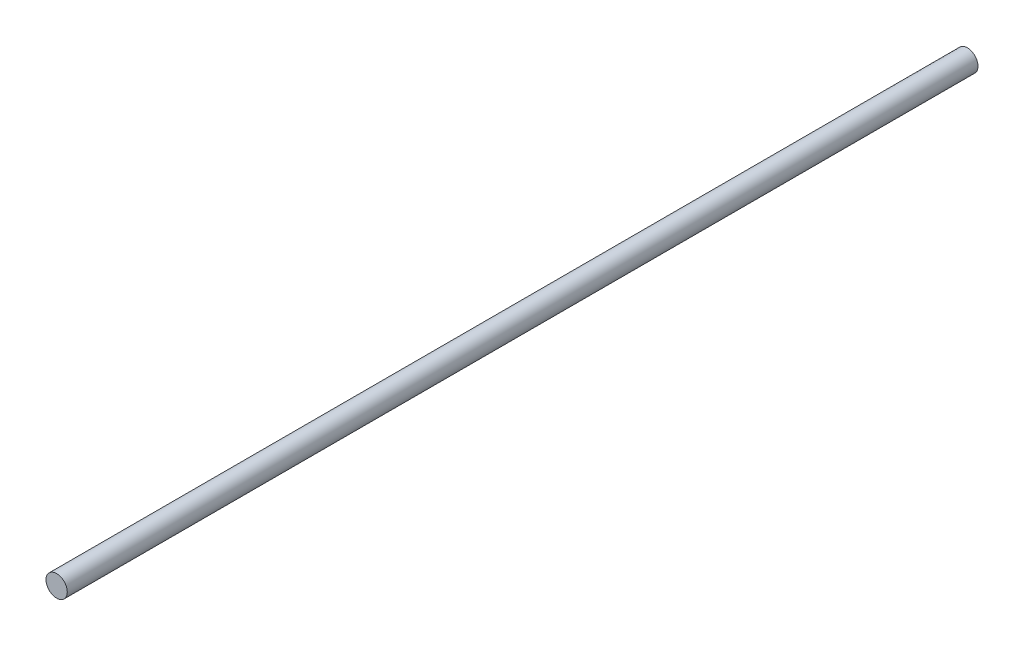
ISO-10303-21;
HEADER;
FILE_DESCRIPTION(('STEP AP214'),'2;1');
FILE_NAME('part.step','',(''),(''),'','','');
FILE_SCHEMA(('AUTOMOTIVE_DESIGN { 1 0 10303 214 1 1 1 1 }'));
ENDSEC;
DATA;
#1=APPLICATION_CONTEXT('core data for automotive mechanical design processes');
#2=APPLICATION_PROTOCOL_DEFINITION('international standard','automotive_design',2000,#1);
#3=PRODUCT_CONTEXT('',#1,'mechanical');
#4=PRODUCT('Part','Part','',(#3));
#5=PRODUCT_RELATED_PRODUCT_CATEGORY('part','',(#4));
#6=PRODUCT_DEFINITION_FORMATION('','',#4);
#7=PRODUCT_DEFINITION_CONTEXT('part definition',#1,'design');
#8=PRODUCT_DEFINITION('design','',#6,#7);
#9=PRODUCT_DEFINITION_SHAPE('','',#8);
#10=(LENGTH_UNIT() NAMED_UNIT(*) SI_UNIT(.MILLI.,.METRE.));
#11=(NAMED_UNIT(*) PLANE_ANGLE_UNIT() SI_UNIT($,.RADIAN.));
#12=(NAMED_UNIT(*) SI_UNIT($,.STERADIAN.) SOLID_ANGLE_UNIT());
#13=UNCERTAINTY_MEASURE_WITH_UNIT(LENGTH_MEASURE(1.E-05),#10,'distance_accuracy_value','');
#14=(GEOMETRIC_REPRESENTATION_CONTEXT(3) GLOBAL_UNCERTAINTY_ASSIGNED_CONTEXT((#13)) GLOBAL_UNIT_ASSIGNED_CONTEXT((#10,
#11,#12)) REPRESENTATION_CONTEXT('',''));
#15=CARTESIAN_POINT('',(0.,0.,0.));
#16=DIRECTION('',(0.,0.,1.));
#17=DIRECTION('',(1.,0.,0.));
#18=AXIS2_PLACEMENT_3D('',#15,#16,#17);
#19=CARTESIAN_POINT('',(0.,0.,171.));
#20=DIRECTION('',(0.,0.,-1.));
#21=DIRECTION('',(-1.,0.,0.));
#22=AXIS2_PLACEMENT_3D('',#19,#20,#21);
#23=CYLINDRICAL_SURFACE('',#22,4.);
#24=CARTESIAN_POINT('',(0.,0.,171.));
#25=DIRECTION('',(0.,0.,1.));
#26=DIRECTION('',(1.,0.,0.));
#27=AXIS2_PLACEMENT_3D('',#24,#25,#26);
#28=CIRCLE('',#27,4.);
#29=CARTESIAN_POINT('',(4.,0.,171.));
#30=VERTEX_POINT('',#29);
#31=EDGE_CURVE('E10',#30,#30,#28,.T.);
#32=ORIENTED_EDGE('',*,*,#31,.F.);
#33=EDGE_LOOP('',(#32));
#34=FACE_BOUND('',#33,.T.);
#35=CARTESIAN_POINT('',(0.,0.,-171.));
#36=DIRECTION('',(0.,0.,1.));
#37=DIRECTION('',(1.,0.,0.));
#38=AXIS2_PLACEMENT_3D('',#35,#36,#37);
#39=CIRCLE('',#38,4.);
#40=CARTESIAN_POINT('',(4.,0.,-171.));
#41=VERTEX_POINT('',#40);
#42=EDGE_CURVE('E33',#41,#41,#39,.T.);
#43=ORIENTED_EDGE('',*,*,#42,.T.);
#44=EDGE_LOOP('',(#43));
#45=FACE_BOUND('',#44,.T.);
#46=ADVANCED_FACE('F30',(#34,#45),#23,.T.);
#47=CARTESIAN_POINT('',(0.,0.,171.));
#48=DIRECTION('',(0.,0.,1.));
#49=DIRECTION('',(1.,0.,0.));
#50=AXIS2_PLACEMENT_3D('',#47,#48,#49);
#51=PLANE('',#50);
#52=ORIENTED_EDGE('',*,*,#31,.T.);
#53=EDGE_LOOP('',(#52));
#54=FACE_BOUND('',#53,.T.);
#55=ADVANCED_FACE('F45',(#54),#51,.T.);
#56=CARTESIAN_POINT('',(0.,0.,-171.));
#57=DIRECTION('',(0.,0.,1.));
#58=DIRECTION('',(1.,0.,0.));
#59=AXIS2_PLACEMENT_3D('',#56,#57,#58);
#60=PLANE('',#59);
#61=ORIENTED_EDGE('',*,*,#42,.F.);
#62=EDGE_LOOP('',(#61));
#63=FACE_BOUND('',#62,.T.);
#64=ADVANCED_FACE('F43',(#63),#60,.F.);
#65=CLOSED_SHELL('',(#46,#55,#64));
#66=MANIFOLD_SOLID_BREP('B2',#65);
#67=ADVANCED_BREP_SHAPE_REPRESENTATION('',(#18,#66),#14);
#68=SHAPE_DEFINITION_REPRESENTATION(#9,#67);
ENDSEC;
END-ISO-10303-21;
